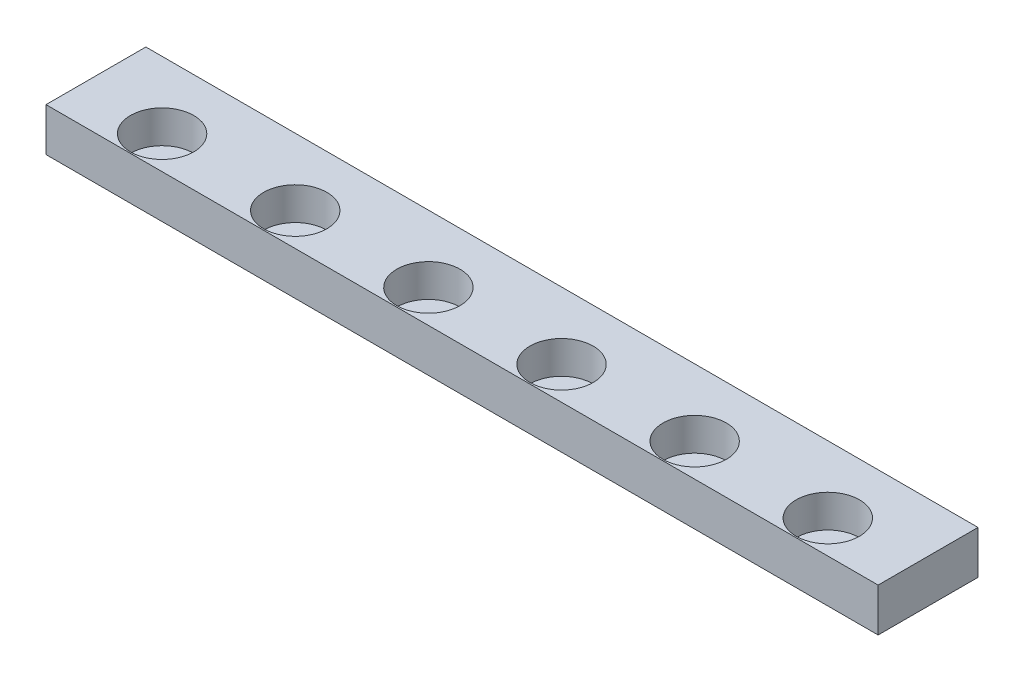
ISO-10303-21;
HEADER;
FILE_DESCRIPTION(('STEP AP214'),'2;1');
FILE_NAME('part.step','',(''),(''),'','','');
FILE_SCHEMA(('AUTOMOTIVE_DESIGN { 1 0 10303 214 1 1 1 1 }'));
ENDSEC;
DATA;
#1=APPLICATION_CONTEXT('core data for automotive mechanical design processes');
#2=APPLICATION_PROTOCOL_DEFINITION('international standard','automotive_design',2000,#1);
#3=PRODUCT_CONTEXT('',#1,'mechanical');
#4=PRODUCT('Part','Part','',(#3));
#5=PRODUCT_RELATED_PRODUCT_CATEGORY('part','',(#4));
#6=PRODUCT_DEFINITION_FORMATION('','',#4);
#7=PRODUCT_DEFINITION_CONTEXT('part definition',#1,'design');
#8=PRODUCT_DEFINITION('design','',#6,#7);
#9=PRODUCT_DEFINITION_SHAPE('','',#8);
#10=(LENGTH_UNIT() NAMED_UNIT(*) SI_UNIT(.MILLI.,.METRE.));
#11=(NAMED_UNIT(*) PLANE_ANGLE_UNIT() SI_UNIT($,.RADIAN.));
#12=(NAMED_UNIT(*) SI_UNIT($,.STERADIAN.) SOLID_ANGLE_UNIT());
#13=UNCERTAINTY_MEASURE_WITH_UNIT(LENGTH_MEASURE(1.E-05),#10,'distance_accuracy_value','');
#14=(GEOMETRIC_REPRESENTATION_CONTEXT(3) GLOBAL_UNCERTAINTY_ASSIGNED_CONTEXT((#13)) GLOBAL_UNIT_ASSIGNED_CONTEXT((#10,
#11,#12)) REPRESENTATION_CONTEXT('',''));
#15=CARTESIAN_POINT('',(0.,0.,0.));
#16=DIRECTION('',(0.,0.,1.));
#17=DIRECTION('',(1.,0.,0.));
#18=AXIS2_PLACEMENT_3D('',#15,#16,#17);
#19=CARTESIAN_POINT('',(-31.75,3.302,3.81));
#20=DIRECTION('',(1.,0.,0.));
#21=DIRECTION('',(0.,0.,-1.));
#22=AXIS2_PLACEMENT_3D('',#19,#20,#21);
#23=PLANE('',#22);
#24=DIRECTION('',(0.,0.,1.));
#25=VECTOR('',#24,1.);
#26=CARTESIAN_POINT('',(-31.75,0.,3.81));
#27=LINE('',#26,#25);
#28=CARTESIAN_POINT('',(-31.75,0.,-3.81));
#29=VERTEX_POINT('',#28);
#30=CARTESIAN_POINT('',(-31.75,0.,3.81));
#31=VERTEX_POINT('',#30);
#32=EDGE_CURVE('E107',#29,#31,#27,.T.);
#33=ORIENTED_EDGE('',*,*,#32,.T.);
#34=DIRECTION('',(0.,-1.,0.));
#35=VECTOR('',#34,1.);
#36=CARTESIAN_POINT('',(-31.75,3.302,3.81));
#37=LINE('',#36,#35);
#38=CARTESIAN_POINT('',(-31.75,3.302,3.81));
#39=VERTEX_POINT('',#38);
#40=EDGE_CURVE('E11',#39,#31,#37,.T.);
#41=ORIENTED_EDGE('',*,*,#40,.F.);
#42=DIRECTION('',(0.,0.,1.));
#43=VECTOR('',#42,1.);
#44=CARTESIAN_POINT('',(-31.75,3.302,3.81));
#45=LINE('',#44,#43);
#46=CARTESIAN_POINT('',(-31.75,3.302,-3.81));
#47=VERTEX_POINT('',#46);
#48=EDGE_CURVE('E91',#47,#39,#45,.T.);
#49=ORIENTED_EDGE('',*,*,#48,.F.);
#50=DIRECTION('',(0.,-1.,0.));
#51=VECTOR('',#50,1.);
#52=CARTESIAN_POINT('',(-31.75,3.302,-3.81));
#53=LINE('',#52,#51);
#54=EDGE_CURVE('E103',#47,#29,#53,.T.);
#55=ORIENTED_EDGE('',*,*,#54,.T.);
#56=EDGE_LOOP('',(#33,#41,#49,#55));
#57=FACE_BOUND('',#56,.T.);
#58=ADVANCED_FACE('F39',(#57),#23,.F.);
#59=CARTESIAN_POINT('',(31.75,3.302,3.81));
#60=DIRECTION('',(0.,0.,-1.));
#61=DIRECTION('',(-1.,0.,0.));
#62=AXIS2_PLACEMENT_3D('',#59,#60,#61);
#63=PLANE('',#62);
#64=DIRECTION('',(1.,0.,0.));
#65=VECTOR('',#64,1.);
#66=CARTESIAN_POINT('',(31.75,0.,3.81));
#67=LINE('',#66,#65);
#68=CARTESIAN_POINT('',(31.75,0.,3.81));
#69=VERTEX_POINT('',#68);
#70=EDGE_CURVE('E96',#31,#69,#67,.T.);
#71=ORIENTED_EDGE('',*,*,#70,.T.);
#72=DIRECTION('',(0.,-1.,0.));
#73=VECTOR('',#72,1.);
#74=CARTESIAN_POINT('',(31.75,3.302,3.81));
#75=LINE('',#74,#73);
#76=CARTESIAN_POINT('',(31.75,3.302,3.81));
#77=VERTEX_POINT('',#76);
#78=EDGE_CURVE('E48',#77,#69,#75,.T.);
#79=ORIENTED_EDGE('',*,*,#78,.F.);
#80=DIRECTION('',(1.,0.,0.));
#81=VECTOR('',#80,1.);
#82=CARTESIAN_POINT('',(31.75,3.302,3.81));
#83=LINE('',#82,#81);
#84=EDGE_CURVE('E86',#39,#77,#83,.T.);
#85=ORIENTED_EDGE('',*,*,#84,.F.);
#86=ORIENTED_EDGE('',*,*,#40,.T.);
#87=EDGE_LOOP('',(#71,#79,#85,#86));
#88=FACE_BOUND('',#87,.T.);
#89=ADVANCED_FACE('F95',(#88),#63,.F.);
#90=CARTESIAN_POINT('',(31.75,3.302,3.81));
#91=DIRECTION('',(-1.,0.,0.));
#92=DIRECTION('',(0.,0.,1.));
#93=AXIS2_PLACEMENT_3D('',#90,#91,#92);
#94=PLANE('',#93);
#95=DIRECTION('',(0.,0.,-1.));
#96=VECTOR('',#95,1.);
#97=CARTESIAN_POINT('',(31.75,0.,3.81));
#98=LINE('',#97,#96);
#99=CARTESIAN_POINT('',(31.75,0.,-3.81));
#100=VERTEX_POINT('',#99);
#101=EDGE_CURVE('E73',#69,#100,#98,.T.);
#102=ORIENTED_EDGE('',*,*,#101,.T.);
#103=DIRECTION('',(0.,-1.,0.));
#104=VECTOR('',#103,1.);
#105=CARTESIAN_POINT('',(31.75,3.302,-3.81));
#106=LINE('',#105,#104);
#107=CARTESIAN_POINT('',(31.75,3.302,-3.81));
#108=VERTEX_POINT('',#107);
#109=EDGE_CURVE('E98',#108,#100,#106,.T.);
#110=ORIENTED_EDGE('',*,*,#109,.F.);
#111=DIRECTION('',(0.,0.,-1.));
#112=VECTOR('',#111,1.);
#113=CARTESIAN_POINT('',(31.75,3.302,3.81));
#114=LINE('',#113,#112);
#115=EDGE_CURVE('E89',#77,#108,#114,.T.);
#116=ORIENTED_EDGE('',*,*,#115,.F.);
#117=ORIENTED_EDGE('',*,*,#78,.T.);
#118=EDGE_LOOP('',(#102,#110,#116,#117));
#119=FACE_BOUND('',#118,.T.);
#120=ADVANCED_FACE('F99',(#119),#94,.F.);
#121=CARTESIAN_POINT('',(31.75,3.302,-3.81));
#122=DIRECTION('',(0.,0.,1.));
#123=DIRECTION('',(1.,0.,0.));
#124=AXIS2_PLACEMENT_3D('',#121,#122,#123);
#125=PLANE('',#124);
#126=DIRECTION('',(-1.,0.,0.));
#127=VECTOR('',#126,1.);
#128=CARTESIAN_POINT('',(31.75,0.,-3.81));
#129=LINE('',#128,#127);
#130=EDGE_CURVE('E79',#100,#29,#129,.T.);
#131=ORIENTED_EDGE('',*,*,#130,.T.);
#132=ORIENTED_EDGE('',*,*,#54,.F.);
#133=DIRECTION('',(-1.,0.,0.));
#134=VECTOR('',#133,1.);
#135=CARTESIAN_POINT('',(31.75,3.302,-3.81));
#136=LINE('',#135,#134);
#137=EDGE_CURVE('E56',#108,#47,#136,.T.);
#138=ORIENTED_EDGE('',*,*,#137,.F.);
#139=ORIENTED_EDGE('',*,*,#109,.T.);
#140=EDGE_LOOP('',(#131,#132,#138,#139));
#141=FACE_BOUND('',#140,.T.);
#142=ADVANCED_FACE('F121',(#141),#125,.F.);
#143=CARTESIAN_POINT('',(0.,3.302,0.));
#144=DIRECTION('',(0.,1.,0.));
#145=DIRECTION('',(0.,0.,1.));
#146=AXIS2_PLACEMENT_3D('',#143,#144,#145);
#147=PLANE('',#146);
#148=CARTESIAN_POINT('',(-25.4,3.302,1.3));
#149=DIRECTION('',(0.,1.,0.));
#150=DIRECTION('',(0.,0.,1.));
#151=AXIS2_PLACEMENT_3D('',#148,#149,#150);
#152=CIRCLE('',#151,2.413);
#153=CARTESIAN_POINT('',(-25.4,3.302,3.713));
#154=VERTEX_POINT('',#153);
#155=EDGE_CURVE('E136',#154,#154,#152,.T.);
#156=ORIENTED_EDGE('',*,*,#155,.F.);
#157=EDGE_LOOP('',(#156));
#158=FACE_BOUND('',#157,.T.);
#159=CARTESIAN_POINT('',(5.08,3.302,1.29999999999986));
#160=DIRECTION('',(0.,1.,0.));
#161=DIRECTION('',(0.,0.,1.));
#162=AXIS2_PLACEMENT_3D('',#159,#160,#161);
#163=CIRCLE('',#162,2.413);
#164=CARTESIAN_POINT('',(5.08,3.302,3.71299999999986));
#165=VERTEX_POINT('',#164);
#166=EDGE_CURVE('E154',#165,#165,#163,.T.);
#167=ORIENTED_EDGE('',*,*,#166,.F.);
#168=EDGE_LOOP('',(#167));
#169=FACE_BOUND('',#168,.T.);
#170=CARTESIAN_POINT('',(15.24,3.302,1.29999999999986));
#171=DIRECTION('',(0.,1.,0.));
#172=DIRECTION('',(0.,0.,1.));
#173=AXIS2_PLACEMENT_3D('',#170,#171,#172);
#174=CIRCLE('',#173,2.413);
#175=CARTESIAN_POINT('',(15.24,3.302,3.71299999999986));
#176=VERTEX_POINT('',#175);
#177=EDGE_CURVE('E145',#176,#176,#174,.T.);
#178=ORIENTED_EDGE('',*,*,#177,.F.);
#179=EDGE_LOOP('',(#178));
#180=FACE_BOUND('',#179,.T.);
#181=CARTESIAN_POINT('',(25.4,3.302,1.29999999999986));
#182=DIRECTION('',(0.,1.,0.));
#183=DIRECTION('',(0.,0.,1.));
#184=AXIS2_PLACEMENT_3D('',#181,#182,#183);
#185=CIRCLE('',#184,2.413);
#186=CARTESIAN_POINT('',(25.4,3.302,3.71299999999986));
#187=VERTEX_POINT('',#186);
#188=EDGE_CURVE('E168',#187,#187,#185,.T.);
#189=ORIENTED_EDGE('',*,*,#188,.F.);
#190=EDGE_LOOP('',(#189));
#191=FACE_BOUND('',#190,.T.);
#192=CARTESIAN_POINT('',(-15.24,3.302,1.30000000000007));
#193=DIRECTION('',(0.,1.,0.));
#194=DIRECTION('',(0.,0.,1.));
#195=AXIS2_PLACEMENT_3D('',#192,#193,#194);
#196=CIRCLE('',#195,2.413);
#197=CARTESIAN_POINT('',(-15.24,3.302,3.71300000000007));
#198=VERTEX_POINT('',#197);
#199=EDGE_CURVE('E144',#198,#198,#196,.T.);
#200=ORIENTED_EDGE('',*,*,#199,.F.);
#201=EDGE_LOOP('',(#200));
#202=FACE_BOUND('',#201,.T.);
#203=CARTESIAN_POINT('',(-5.08,3.302,1.3));
#204=DIRECTION('',(0.,1.,0.));
#205=DIRECTION('',(0.,0.,1.));
#206=AXIS2_PLACEMENT_3D('',#203,#204,#205);
#207=CIRCLE('',#206,2.413);
#208=CARTESIAN_POINT('',(-5.08,3.302,3.713));
#209=VERTEX_POINT('',#208);
#210=EDGE_CURVE('E128',#209,#209,#207,.T.);
#211=ORIENTED_EDGE('',*,*,#210,.F.);
#212=EDGE_LOOP('',(#211));
#213=FACE_BOUND('',#212,.T.);
#214=ORIENTED_EDGE('',*,*,#48,.T.);
#215=ORIENTED_EDGE('',*,*,#84,.T.);
#216=ORIENTED_EDGE('',*,*,#115,.T.);
#217=ORIENTED_EDGE('',*,*,#137,.T.);
#218=EDGE_LOOP('',(#214,#215,#216,#217));
#219=FACE_BOUND('',#218,.T.);
#220=ADVANCED_FACE('F87',(#158,#169,#180,#191,#202,#213,#219),#147,.T.);
#221=CARTESIAN_POINT('',(0.,0.,0.));
#222=DIRECTION('',(0.,1.,0.));
#223=DIRECTION('',(0.,0.,1.));
#224=AXIS2_PLACEMENT_3D('',#221,#222,#223);
#225=PLANE('',#224);
#226=ORIENTED_EDGE('',*,*,#32,.F.);
#227=ORIENTED_EDGE('',*,*,#130,.F.);
#228=ORIENTED_EDGE('',*,*,#101,.F.);
#229=ORIENTED_EDGE('',*,*,#70,.F.);
#230=EDGE_LOOP('',(#226,#227,#228,#229));
#231=FACE_BOUND('',#230,.T.);
#232=ADVANCED_FACE('F124',(#231),#225,.F.);
#233=CARTESIAN_POINT('',(-5.08,0.802,1.3));
#234=DIRECTION('',(0.,1.,0.));
#235=DIRECTION('',(0.,0.,1.));
#236=AXIS2_PLACEMENT_3D('',#233,#234,#235);
#237=CYLINDRICAL_SURFACE('',#236,2.413);
#238=CARTESIAN_POINT('',(-5.08,0.802,1.3));
#239=DIRECTION('',(0.,1.,0.));
#240=DIRECTION('',(0.,0.,1.));
#241=AXIS2_PLACEMENT_3D('',#238,#239,#240);
#242=CIRCLE('',#241,2.413);
#243=CARTESIAN_POINT('',(-5.08,0.802,3.713));
#244=VERTEX_POINT('',#243);
#245=EDGE_CURVE('E111',#244,#244,#242,.T.);
#246=ORIENTED_EDGE('',*,*,#245,.F.);
#247=EDGE_LOOP('',(#246));
#248=FACE_BOUND('',#247,.T.);
#249=ORIENTED_EDGE('',*,*,#210,.T.);
#250=EDGE_LOOP('',(#249));
#251=FACE_BOUND('',#250,.T.);
#252=ADVANCED_FACE('F193',(#248,#251),#237,.F.);
#253=CARTESIAN_POINT('',(-5.08,0.802,1.3));
#254=DIRECTION('',(0.,1.,0.));
#255=DIRECTION('',(0.,0.,1.));
#256=AXIS2_PLACEMENT_3D('',#253,#254,#255);
#257=PLANE('',#256);
#258=ORIENTED_EDGE('',*,*,#245,.T.);
#259=EDGE_LOOP('',(#258));
#260=FACE_BOUND('',#259,.T.);
#261=ADVANCED_FACE('F195',(#260),#257,.T.);
#262=CARTESIAN_POINT('',(-15.24,0.802,1.30000000000007));
#263=DIRECTION('',(0.,1.,0.));
#264=DIRECTION('',(0.,0.,1.));
#265=AXIS2_PLACEMENT_3D('',#262,#263,#264);
#266=CYLINDRICAL_SURFACE('',#265,2.413);
#267=CARTESIAN_POINT('',(-15.24,0.802,1.30000000000007));
#268=DIRECTION('',(0.,1.,0.));
#269=DIRECTION('',(0.,0.,1.));
#270=AXIS2_PLACEMENT_3D('',#267,#268,#269);
#271=CIRCLE('',#270,2.413);
#272=CARTESIAN_POINT('',(-15.24,0.802,3.71300000000007));
#273=VERTEX_POINT('',#272);
#274=EDGE_CURVE('E164',#273,#273,#271,.T.);
#275=ORIENTED_EDGE('',*,*,#274,.F.);
#276=EDGE_LOOP('',(#275));
#277=FACE_BOUND('',#276,.T.);
#278=ORIENTED_EDGE('',*,*,#199,.T.);
#279=EDGE_LOOP('',(#278));
#280=FACE_BOUND('',#279,.T.);
#281=ADVANCED_FACE('F202',(#277,#280),#266,.F.);
#282=CARTESIAN_POINT('',(-15.24,0.802,1.30000000000007));
#283=DIRECTION('',(0.,1.,0.));
#284=DIRECTION('',(0.,0.,1.));
#285=AXIS2_PLACEMENT_3D('',#282,#283,#284);
#286=PLANE('',#285);
#287=ORIENTED_EDGE('',*,*,#274,.T.);
#288=EDGE_LOOP('',(#287));
#289=FACE_BOUND('',#288,.T.);
#290=ADVANCED_FACE('F181',(#289),#286,.T.);
#291=CARTESIAN_POINT('',(25.4,0.802,1.29999999999986));
#292=DIRECTION('',(0.,1.,0.));
#293=DIRECTION('',(0.,0.,1.));
#294=AXIS2_PLACEMENT_3D('',#291,#292,#293);
#295=CYLINDRICAL_SURFACE('',#294,2.413);
#296=CARTESIAN_POINT('',(25.4,0.802,1.29999999999986));
#297=DIRECTION('',(0.,1.,0.));
#298=DIRECTION('',(0.,0.,1.));
#299=AXIS2_PLACEMENT_3D('',#296,#297,#298);
#300=CIRCLE('',#299,2.413);
#301=CARTESIAN_POINT('',(25.4,0.802,3.71299999999986));
#302=VERTEX_POINT('',#301);
#303=EDGE_CURVE('E150',#302,#302,#300,.T.);
#304=ORIENTED_EDGE('',*,*,#303,.F.);
#305=EDGE_LOOP('',(#304));
#306=FACE_BOUND('',#305,.T.);
#307=ORIENTED_EDGE('',*,*,#188,.T.);
#308=EDGE_LOOP('',(#307));
#309=FACE_BOUND('',#308,.T.);
#310=ADVANCED_FACE('F178',(#306,#309),#295,.F.);
#311=CARTESIAN_POINT('',(25.4,0.802,1.29999999999986));
#312=DIRECTION('',(0.,1.,0.));
#313=DIRECTION('',(0.,0.,1.));
#314=AXIS2_PLACEMENT_3D('',#311,#312,#313);
#315=PLANE('',#314);
#316=ORIENTED_EDGE('',*,*,#303,.T.);
#317=EDGE_LOOP('',(#316));
#318=FACE_BOUND('',#317,.T.);
#319=ADVANCED_FACE('F176',(#318),#315,.T.);
#320=CARTESIAN_POINT('',(15.24,0.802,1.29999999999986));
#321=DIRECTION('',(0.,1.,0.));
#322=DIRECTION('',(0.,0.,1.));
#323=AXIS2_PLACEMENT_3D('',#320,#321,#322);
#324=CYLINDRICAL_SURFACE('',#323,2.413);
#325=CARTESIAN_POINT('',(15.24,0.802,1.29999999999986));
#326=DIRECTION('',(0.,1.,0.));
#327=DIRECTION('',(0.,0.,1.));
#328=AXIS2_PLACEMENT_3D('',#325,#326,#327);
#329=CIRCLE('',#328,2.413);
#330=CARTESIAN_POINT('',(15.24,0.802,3.71299999999986));
#331=VERTEX_POINT('',#330);
#332=EDGE_CURVE('E149',#331,#331,#329,.T.);
#333=ORIENTED_EDGE('',*,*,#332,.F.);
#334=EDGE_LOOP('',(#333));
#335=FACE_BOUND('',#334,.T.);
#336=ORIENTED_EDGE('',*,*,#177,.T.);
#337=EDGE_LOOP('',(#336));
#338=FACE_BOUND('',#337,.T.);
#339=ADVANCED_FACE('F271',(#335,#338),#324,.F.);
#340=CARTESIAN_POINT('',(15.24,0.802,1.29999999999986));
#341=DIRECTION('',(0.,1.,0.));
#342=DIRECTION('',(0.,0.,1.));
#343=AXIS2_PLACEMENT_3D('',#340,#341,#342);
#344=PLANE('',#343);
#345=ORIENTED_EDGE('',*,*,#332,.T.);
#346=EDGE_LOOP('',(#345));
#347=FACE_BOUND('',#346,.T.);
#348=ADVANCED_FACE('F279',(#347),#344,.T.);
#349=CARTESIAN_POINT('',(5.08,0.802,1.29999999999986));
#350=DIRECTION('',(0.,1.,0.));
#351=DIRECTION('',(0.,0.,1.));
#352=AXIS2_PLACEMENT_3D('',#349,#350,#351);
#353=CYLINDRICAL_SURFACE('',#352,2.413);
#354=CARTESIAN_POINT('',(5.08,0.802,1.29999999999986));
#355=DIRECTION('',(0.,1.,0.));
#356=DIRECTION('',(0.,0.,1.));
#357=AXIS2_PLACEMENT_3D('',#354,#355,#356);
#358=CIRCLE('',#357,2.413);
#359=CARTESIAN_POINT('',(5.08,0.802,3.71299999999986));
#360=VERTEX_POINT('',#359);
#361=EDGE_CURVE('E132',#360,#360,#358,.T.);
#362=ORIENTED_EDGE('',*,*,#361,.F.);
#363=EDGE_LOOP('',(#362));
#364=FACE_BOUND('',#363,.T.);
#365=ORIENTED_EDGE('',*,*,#166,.T.);
#366=EDGE_LOOP('',(#365));
#367=FACE_BOUND('',#366,.T.);
#368=ADVANCED_FACE('F288',(#364,#367),#353,.F.);
#369=CARTESIAN_POINT('',(5.08,0.802,1.29999999999986));
#370=DIRECTION('',(0.,1.,0.));
#371=DIRECTION('',(0.,0.,1.));
#372=AXIS2_PLACEMENT_3D('',#369,#370,#371);
#373=PLANE('',#372);
#374=ORIENTED_EDGE('',*,*,#361,.T.);
#375=EDGE_LOOP('',(#374));
#376=FACE_BOUND('',#375,.T.);
#377=ADVANCED_FACE('F297',(#376),#373,.T.);
#378=CARTESIAN_POINT('',(-25.4,0.802,1.3));
#379=DIRECTION('',(0.,1.,0.));
#380=DIRECTION('',(0.,0.,1.));
#381=AXIS2_PLACEMENT_3D('',#378,#379,#380);
#382=CYLINDRICAL_SURFACE('',#381,2.413);
#383=CARTESIAN_POINT('',(-25.4,0.802,1.3));
#384=DIRECTION('',(0.,1.,0.));
#385=DIRECTION('',(0.,0.,1.));
#386=AXIS2_PLACEMENT_3D('',#383,#384,#385);
#387=CIRCLE('',#386,2.413);
#388=CARTESIAN_POINT('',(-25.4,0.802,3.713));
#389=VERTEX_POINT('',#388);
#390=EDGE_CURVE('E140',#389,#389,#387,.T.);
#391=ORIENTED_EDGE('',*,*,#390,.F.);
#392=EDGE_LOOP('',(#391));
#393=FACE_BOUND('',#392,.T.);
#394=ORIENTED_EDGE('',*,*,#155,.T.);
#395=EDGE_LOOP('',(#394));
#396=FACE_BOUND('',#395,.T.);
#397=ADVANCED_FACE('F306',(#393,#396),#382,.F.);
#398=CARTESIAN_POINT('',(-25.4,0.802,1.3));
#399=DIRECTION('',(0.,1.,0.));
#400=DIRECTION('',(0.,0.,1.));
#401=AXIS2_PLACEMENT_3D('',#398,#399,#400);
#402=PLANE('',#401);
#403=ORIENTED_EDGE('',*,*,#390,.T.);
#404=EDGE_LOOP('',(#403));
#405=FACE_BOUND('',#404,.T.);
#406=ADVANCED_FACE('F315',(#405),#402,.T.);
#407=CLOSED_SHELL('',(#58,#89,#120,#142,#220,#232,#252,#261,#281,#290,#310,#319,#339,#348,#368,
#377,#397,#406));
#408=MANIFOLD_SOLID_BREP('B2',#407);
#409=ADVANCED_BREP_SHAPE_REPRESENTATION('',(#18,#408),#14);
#410=SHAPE_DEFINITION_REPRESENTATION(#9,#409);
ENDSEC;
END-ISO-10303-21;
